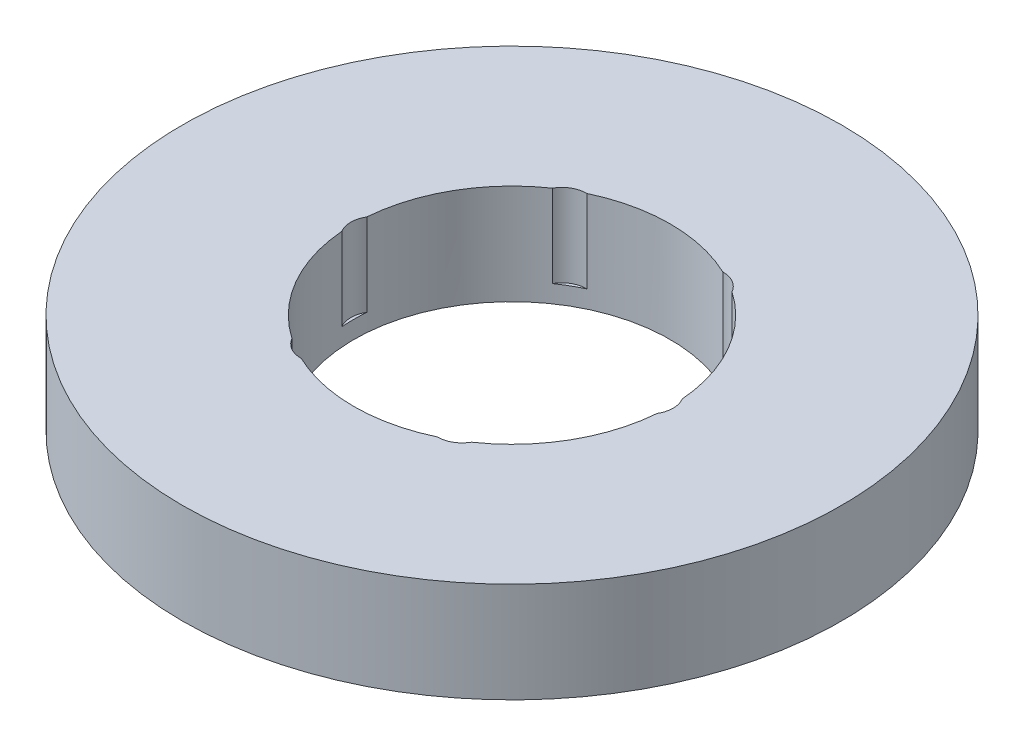
ISO-10303-21;
HEADER;
FILE_DESCRIPTION(('STEP AP214'),'2;1');
FILE_NAME('part.step','',(''),(''),'','','');
FILE_SCHEMA(('AUTOMOTIVE_DESIGN { 1 0 10303 214 1 1 1 1 }'));
ENDSEC;
DATA;
#1=APPLICATION_CONTEXT('core data for automotive mechanical design processes');
#2=APPLICATION_PROTOCOL_DEFINITION('international standard','automotive_design',2000,#1);
#3=PRODUCT_CONTEXT('',#1,'mechanical');
#4=PRODUCT('Part','Part','',(#3));
#5=PRODUCT_RELATED_PRODUCT_CATEGORY('part','',(#4));
#6=PRODUCT_DEFINITION_FORMATION('','',#4);
#7=PRODUCT_DEFINITION_CONTEXT('part definition',#1,'design');
#8=PRODUCT_DEFINITION('design','',#6,#7);
#9=PRODUCT_DEFINITION_SHAPE('','',#8);
#10=(LENGTH_UNIT() NAMED_UNIT(*) SI_UNIT(.MILLI.,.METRE.));
#11=(NAMED_UNIT(*) PLANE_ANGLE_UNIT() SI_UNIT($,.RADIAN.));
#12=(NAMED_UNIT(*) SI_UNIT($,.STERADIAN.) SOLID_ANGLE_UNIT());
#13=UNCERTAINTY_MEASURE_WITH_UNIT(LENGTH_MEASURE(1.E-05),#10,'distance_accuracy_value','');
#14=(GEOMETRIC_REPRESENTATION_CONTEXT(3) GLOBAL_UNCERTAINTY_ASSIGNED_CONTEXT((#13)) GLOBAL_UNIT_ASSIGNED_CONTEXT((#10,
#11,#12)) REPRESENTATION_CONTEXT('',''));
#15=CARTESIAN_POINT('',(0.,0.,0.));
#16=DIRECTION('',(0.,0.,1.));
#17=DIRECTION('',(1.,0.,0.));
#18=AXIS2_PLACEMENT_3D('',#15,#16,#17);
#19=CARTESIAN_POINT('',(0.,19.,0.));
#20=DIRECTION('',(0.,-1.,0.));
#21=DIRECTION('',(0.,0.,-1.));
#22=AXIS2_PLACEMENT_3D('',#19,#20,#21);
#23=CYLINDRICAL_SURFACE('',#22,62.5);
#24=CARTESIAN_POINT('',(0.,19.,0.));
#25=DIRECTION('',(0.,1.,0.));
#26=DIRECTION('',(0.,0.,1.));
#27=AXIS2_PLACEMENT_3D('',#24,#25,#26);
#28=CIRCLE('',#27,62.5);
#29=CARTESIAN_POINT('',(0.,19.,62.5));
#30=VERTEX_POINT('',#29);
#31=EDGE_CURVE('E162',#30,#30,#28,.T.);
#32=ORIENTED_EDGE('',*,*,#31,.F.);
#33=EDGE_LOOP('',(#32));
#34=FACE_BOUND('',#33,.T.);
#35=CARTESIAN_POINT('',(0.,0.,0.));
#36=DIRECTION('',(0.,1.,0.));
#37=DIRECTION('',(0.,0.,1.));
#38=AXIS2_PLACEMENT_3D('',#35,#36,#37);
#39=CIRCLE('',#38,62.5);
#40=CARTESIAN_POINT('',(0.,0.,62.5));
#41=VERTEX_POINT('',#40);
#42=EDGE_CURVE('E157',#41,#41,#39,.T.);
#43=ORIENTED_EDGE('',*,*,#42,.T.);
#44=EDGE_LOOP('',(#43));
#45=FACE_BOUND('',#44,.T.);
#46=ADVANCED_FACE('F39',(#34,#45),#23,.T.);
#47=CARTESIAN_POINT('',(0.,19.,0.));
#48=DIRECTION('',(0.,1.,0.));
#49=DIRECTION('',(0.,0.,1.));
#50=AXIS2_PLACEMENT_3D('',#47,#48,#49);
#51=PLANE('',#50);
#52=CARTESIAN_POINT('',(-12.9536574706839,19.,-22.4363928830681));
#53=DIRECTION('',(0.,1.,0.));
#54=DIRECTION('',(-0.866025403784433,0.,0.50000000000001));
#55=AXIS2_PLACEMENT_3D('',#52,#53,#54);
#56=CIRCLE('',#55,4.65275185815203);
#57=CARTESIAN_POINT('',(-12.8918757796627,19.,-27.0887345382125));
#58=VERTEX_POINT('',#57);
#59=CARTESIAN_POINT('',(-17.0135943766342,19.,-24.7090591967271));
#60=VERTEX_POINT('',#59);
#61=EDGE_CURVE('E218',#58,#60,#56,.T.);
#62=ORIENTED_EDGE('',*,*,#61,.F.);
#63=CARTESIAN_POINT('',(0.,19.,0.));
#64=DIRECTION('',(0.,1.,0.));
#65=DIRECTION('',(0.,0.,1.));
#66=AXIS2_PLACEMENT_3D('',#63,#64,#65);
#67=CIRCLE('',#66,30.);
#68=CARTESIAN_POINT('',(12.8918757796621,19.,-27.0887345382128));
#69=VERTEX_POINT('',#68);
#70=EDGE_CURVE('E169',#69,#58,#67,.T.);
#71=ORIENTED_EDGE('',*,*,#70,.F.);
#72=CARTESIAN_POINT('',(12.9536574706834,19.,-22.4363928830684));
#73=DIRECTION('',(0.,1.,0.));
#74=DIRECTION('',(-0.866025403784443,0.,-0.499999999999992));
#75=AXIS2_PLACEMENT_3D('',#72,#73,#74);
#76=CIRCLE('',#75,4.65275185815203);
#77=CARTESIAN_POINT('',(17.0135943766336,19.,-24.7090591967274));
#78=VERTEX_POINT('',#77);
#79=EDGE_CURVE('E285',#78,#69,#76,.T.);
#80=ORIENTED_EDGE('',*,*,#79,.F.);
#81=CARTESIAN_POINT('',(29.9054701562963,19.,-2.37967534148538));
#82=VERTEX_POINT('',#81);
#83=EDGE_CURVE('E174',#82,#78,#67,.T.);
#84=ORIENTED_EDGE('',*,*,#83,.F.);
#85=CARTESIAN_POINT('',(25.9073149413673,19.,0.));
#86=DIRECTION('',(0.,1.,0.));
#87=DIRECTION('',(0.,0.,-1.));
#88=AXIS2_PLACEMENT_3D('',#85,#86,#87);
#89=CIRCLE('',#88,4.65275185815203);
#90=CARTESIAN_POINT('',(29.9054701562963,19.,2.37967534148538));
#91=VERTEX_POINT('',#90);
#92=EDGE_CURVE('E280',#91,#82,#89,.T.);
#93=ORIENTED_EDGE('',*,*,#92,.F.);
#94=CARTESIAN_POINT('',(17.013594376634,19.,24.7090591967272));
#95=VERTEX_POINT('',#94);
#96=EDGE_CURVE('E164',#95,#91,#67,.T.);
#97=ORIENTED_EDGE('',*,*,#96,.F.);
#98=CARTESIAN_POINT('',(12.9536574706838,19.,22.4363928830682));
#99=DIRECTION('',(0.,1.,0.));
#100=DIRECTION('',(0.866025403784436,0.,-0.500000000000004));
#101=AXIS2_PLACEMENT_3D('',#98,#99,#100);
#102=CIRCLE('',#101,4.65275185815203);
#103=CARTESIAN_POINT('',(12.8918757796625,19.,27.0887345382126));
#104=VERTEX_POINT('',#103);
#105=EDGE_CURVE('E269',#104,#95,#102,.T.);
#106=ORIENTED_EDGE('',*,*,#105,.F.);
#107=CARTESIAN_POINT('',(-12.8918757796623,19.,27.0887345382127));
#108=VERTEX_POINT('',#107);
#109=EDGE_CURVE('E149',#108,#104,#67,.T.);
#110=ORIENTED_EDGE('',*,*,#109,.F.);
#111=CARTESIAN_POINT('',(-12.9536574706836,19.,22.4363928830683));
#112=DIRECTION('',(0.,1.,0.));
#113=DIRECTION('',(0.86602540378444,0.,0.499999999999998));
#114=AXIS2_PLACEMENT_3D('',#111,#112,#113);
#115=CIRCLE('',#114,4.65275185815203);
#116=CARTESIAN_POINT('',(-17.0135943766338,19.,24.7090591967273));
#117=VERTEX_POINT('',#116);
#118=EDGE_CURVE('E128',#117,#108,#115,.T.);
#119=ORIENTED_EDGE('',*,*,#118,.F.);
#120=CARTESIAN_POINT('',(-29.9054701562963,19.,2.37967534148538));
#121=VERTEX_POINT('',#120);
#122=EDGE_CURVE('E148',#121,#117,#67,.T.);
#123=ORIENTED_EDGE('',*,*,#122,.F.);
#124=CARTESIAN_POINT('',(-25.9073149413673,19.,0.));
#125=DIRECTION('',(0.,1.,0.));
#126=DIRECTION('',(0.,0.,1.));
#127=AXIS2_PLACEMENT_3D('',#124,#125,#126);
#128=CIRCLE('',#127,4.65275185815203);
#129=CARTESIAN_POINT('',(-29.9054701562963,19.,-2.37967534148538));
#130=VERTEX_POINT('',#129);
#131=EDGE_CURVE('E179',#130,#121,#128,.T.);
#132=ORIENTED_EDGE('',*,*,#131,.F.);
#133=EDGE_CURVE('E161',#60,#130,#67,.T.);
#134=ORIENTED_EDGE('',*,*,#133,.F.);
#135=EDGE_LOOP('',(#62,#71,#80,#84,#93,#97,#106,#110,#119,#123,#132,#134));
#136=FACE_BOUND('',#135,.T.);
#137=ORIENTED_EDGE('',*,*,#31,.T.);
#138=EDGE_LOOP('',(#137));
#139=FACE_BOUND('',#138,.T.);
#140=ADVANCED_FACE('F141',(#136,#139),#51,.T.);
#141=CARTESIAN_POINT('',(0.,0.,0.));
#142=DIRECTION('',(0.,1.,0.));
#143=DIRECTION('',(0.,0.,1.));
#144=AXIS2_PLACEMENT_3D('',#141,#142,#143);
#145=PLANE('',#144);
#146=CARTESIAN_POINT('',(0.,0.,0.));
#147=DIRECTION('',(0.,1.,0.));
#148=DIRECTION('',(0.,0.,1.));
#149=AXIS2_PLACEMENT_3D('',#146,#147,#148);
#150=CIRCLE('',#149,30.);
#151=CARTESIAN_POINT('',(0.,0.,30.));
#152=VERTEX_POINT('',#151);
#153=EDGE_CURVE('E166',#152,#152,#150,.T.);
#154=ORIENTED_EDGE('',*,*,#153,.T.);
#155=EDGE_LOOP('',(#154));
#156=FACE_BOUND('',#155,.T.);
#157=ORIENTED_EDGE('',*,*,#42,.F.);
#158=EDGE_LOOP('',(#157));
#159=FACE_BOUND('',#158,.T.);
#160=ADVANCED_FACE('F234',(#156,#159),#145,.F.);
#161=CARTESIAN_POINT('',(0.,19.,0.));
#162=DIRECTION('',(0.,-1.,0.));
#163=DIRECTION('',(0.,0.,-1.));
#164=AXIS2_PLACEMENT_3D('',#161,#162,#163);
#165=CYLINDRICAL_SURFACE('',#164,30.);
#166=DIRECTION('',(0.,1.,0.));
#167=VECTOR('',#166,1.);
#168=CARTESIAN_POINT('',(-12.8918757796627,11.1623331256231,-27.0887345382125));
#169=LINE('',#168,#167);
#170=CARTESIAN_POINT('',(-12.8918757796627,3.32466625124611,-27.0887345382125));
#171=VERTEX_POINT('',#170);
#172=EDGE_CURVE('E11',#171,#58,#169,.T.);
#173=ORIENTED_EDGE('',*,*,#172,.F.);
#174=CARTESIAN_POINT('',(0.,3.32466625124611,0.));
#175=DIRECTION('',(0.,1.,0.));
#176=DIRECTION('',(0.,0.,1.));
#177=AXIS2_PLACEMENT_3D('',#174,#175,#176);
#178=CIRCLE('',#177,30.);
#179=CARTESIAN_POINT('',(-17.0135943766342,3.32466625124611,-24.7090591967271));
#180=VERTEX_POINT('',#179);
#181=EDGE_CURVE('E214',#171,#180,#178,.T.);
#182=ORIENTED_EDGE('',*,*,#181,.T.);
#183=DIRECTION('',(0.,1.,0.));
#184=VECTOR('',#183,1.);
#185=CARTESIAN_POINT('',(-17.0135943766342,11.1623331256231,-24.7090591967271));
#186=LINE('',#185,#184);
#187=EDGE_CURVE('E46',#60,#180,#186,.F.);
#188=ORIENTED_EDGE('',*,*,#187,.F.);
#189=ORIENTED_EDGE('',*,*,#133,.T.);
#190=DIRECTION('',(0.,1.,0.));
#191=VECTOR('',#190,1.);
#192=CARTESIAN_POINT('',(-29.9054701562963,11.1623331256231,-2.37967534148536));
#193=LINE('',#192,#191);
#194=CARTESIAN_POINT('',(-29.9054701562963,3.32466625124611,-2.37967534148538));
#195=VERTEX_POINT('',#194);
#196=EDGE_CURVE('E187',#195,#130,#193,.T.);
#197=ORIENTED_EDGE('',*,*,#196,.F.);
#198=CARTESIAN_POINT('',(0.,3.32466625124611,0.));
#199=DIRECTION('',(0.,1.,0.));
#200=DIRECTION('',(0.,0.,1.));
#201=AXIS2_PLACEMENT_3D('',#198,#199,#200);
#202=CIRCLE('',#201,30.);
#203=CARTESIAN_POINT('',(-29.9054701562963,3.32466625124611,2.37967534148538));
#204=VERTEX_POINT('',#203);
#205=EDGE_CURVE('E184',#195,#204,#202,.T.);
#206=ORIENTED_EDGE('',*,*,#205,.T.);
#207=DIRECTION('',(0.,1.,0.));
#208=VECTOR('',#207,1.);
#209=CARTESIAN_POINT('',(-29.9054701562963,11.1623331256231,2.37967534148536));
#210=LINE('',#209,#208);
#211=EDGE_CURVE('E158',#121,#204,#210,.F.);
#212=ORIENTED_EDGE('',*,*,#211,.F.);
#213=ORIENTED_EDGE('',*,*,#122,.T.);
#214=DIRECTION('',(0.,1.,0.));
#215=VECTOR('',#214,1.);
#216=CARTESIAN_POINT('',(-17.0135943766338,11.1623331256231,24.7090591967273));
#217=LINE('',#216,#215);
#218=CARTESIAN_POINT('',(-17.0135943766338,3.32466625124611,24.7090591967273));
#219=VERTEX_POINT('',#218);
#220=EDGE_CURVE('E127',#219,#117,#217,.T.);
#221=ORIENTED_EDGE('',*,*,#220,.F.);
#222=CARTESIAN_POINT('',(0.,3.32466625124611,0.));
#223=DIRECTION('',(0.,1.,0.));
#224=DIRECTION('',(0.,0.,1.));
#225=AXIS2_PLACEMENT_3D('',#222,#223,#224);
#226=CIRCLE('',#225,30.);
#227=CARTESIAN_POINT('',(-12.8918757796623,3.32466625124611,27.0887345382127));
#228=VERTEX_POINT('',#227);
#229=EDGE_CURVE('E189',#219,#228,#226,.T.);
#230=ORIENTED_EDGE('',*,*,#229,.T.);
#231=DIRECTION('',(0.,1.,0.));
#232=VECTOR('',#231,1.);
#233=CARTESIAN_POINT('',(-12.8918757796623,11.1623331256231,27.0887345382127));
#234=LINE('',#233,#232);
#235=EDGE_CURVE('E140',#108,#228,#234,.F.);
#236=ORIENTED_EDGE('',*,*,#235,.F.);
#237=ORIENTED_EDGE('',*,*,#109,.T.);
#238=DIRECTION('',(0.,1.,0.));
#239=VECTOR('',#238,1.);
#240=CARTESIAN_POINT('',(12.8918757796625,11.1623331256231,27.0887345382126));
#241=LINE('',#240,#239);
#242=CARTESIAN_POINT('',(12.8918757796625,3.32466625124611,27.0887345382126));
#243=VERTEX_POINT('',#242);
#244=EDGE_CURVE('E196',#243,#104,#241,.T.);
#245=ORIENTED_EDGE('',*,*,#244,.F.);
#246=CARTESIAN_POINT('',(0.,3.32466625124611,0.));
#247=DIRECTION('',(0.,1.,0.));
#248=DIRECTION('',(0.,0.,1.));
#249=AXIS2_PLACEMENT_3D('',#246,#247,#248);
#250=CIRCLE('',#249,30.);
#251=CARTESIAN_POINT('',(17.013594376634,3.32466625124611,24.7090591967272));
#252=VERTEX_POINT('',#251);
#253=EDGE_CURVE('E136',#243,#252,#250,.T.);
#254=ORIENTED_EDGE('',*,*,#253,.T.);
#255=DIRECTION('',(0.,1.,0.));
#256=VECTOR('',#255,1.);
#257=CARTESIAN_POINT('',(17.013594376634,11.1623331256231,24.7090591967272));
#258=LINE('',#257,#256);
#259=EDGE_CURVE('E194',#95,#252,#258,.F.);
#260=ORIENTED_EDGE('',*,*,#259,.F.);
#261=ORIENTED_EDGE('',*,*,#96,.T.);
#262=DIRECTION('',(0.,1.,0.));
#263=VECTOR('',#262,1.);
#264=CARTESIAN_POINT('',(29.9054701562963,11.1623331256231,2.37967534148536));
#265=LINE('',#264,#263);
#266=CARTESIAN_POINT('',(29.9054701562963,3.32466625124611,2.37967534148538));
#267=VERTEX_POINT('',#266);
#268=EDGE_CURVE('E206',#267,#91,#265,.T.);
#269=ORIENTED_EDGE('',*,*,#268,.F.);
#270=CARTESIAN_POINT('',(0.,3.32466625124611,0.));
#271=DIRECTION('',(0.,1.,0.));
#272=DIRECTION('',(0.,0.,1.));
#273=AXIS2_PLACEMENT_3D('',#270,#271,#272);
#274=CIRCLE('',#273,30.);
#275=CARTESIAN_POINT('',(29.9054701562963,3.32466625124611,-2.37967534148538));
#276=VERTEX_POINT('',#275);
#277=EDGE_CURVE('E199',#267,#276,#274,.T.);
#278=ORIENTED_EDGE('',*,*,#277,.T.);
#279=DIRECTION('',(0.,1.,0.));
#280=VECTOR('',#279,1.);
#281=CARTESIAN_POINT('',(29.9054701562963,11.1623331256231,-2.37967534148536));
#282=LINE('',#281,#280);
#283=EDGE_CURVE('E201',#82,#276,#282,.F.);
#284=ORIENTED_EDGE('',*,*,#283,.F.);
#285=ORIENTED_EDGE('',*,*,#83,.T.);
#286=DIRECTION('',(0.,1.,0.));
#287=VECTOR('',#286,1.);
#288=CARTESIAN_POINT('',(17.0135943766336,11.1623331256231,-24.7090591967274));
#289=LINE('',#288,#287);
#290=CARTESIAN_POINT('',(17.0135943766336,3.32466625124611,-24.7090591967274));
#291=VERTEX_POINT('',#290);
#292=EDGE_CURVE('E213',#291,#78,#289,.T.);
#293=ORIENTED_EDGE('',*,*,#292,.F.);
#294=CARTESIAN_POINT('',(0.,3.32466625124611,0.));
#295=DIRECTION('',(0.,1.,0.));
#296=DIRECTION('',(0.,0.,1.));
#297=AXIS2_PLACEMENT_3D('',#294,#295,#296);
#298=CIRCLE('',#297,30.);
#299=CARTESIAN_POINT('',(12.8918757796621,3.32466625124611,-27.0887345382128));
#300=VERTEX_POINT('',#299);
#301=EDGE_CURVE('E208',#291,#300,#298,.T.);
#302=ORIENTED_EDGE('',*,*,#301,.T.);
#303=DIRECTION('',(0.,1.,0.));
#304=VECTOR('',#303,1.);
#305=CARTESIAN_POINT('',(12.8918757796622,11.1623331256231,-27.0887345382128));
#306=LINE('',#305,#304);
#307=EDGE_CURVE('E211',#69,#300,#306,.F.);
#308=ORIENTED_EDGE('',*,*,#307,.F.);
#309=ORIENTED_EDGE('',*,*,#70,.T.);
#310=EDGE_LOOP('',(#173,#182,#188,#189,#197,#206,#212,#213,#221,#230,#236,#237,#245,#254,#260,
#261,#269,#278,#284,#285,#293,#302,#308,#309));
#311=FACE_BOUND('',#310,.T.);
#312=ORIENTED_EDGE('',*,*,#153,.F.);
#313=EDGE_LOOP('',(#312));
#314=FACE_BOUND('',#313,.T.);
#315=ADVANCED_FACE('F152',(#311,#314),#165,.F.);
#316=CARTESIAN_POINT('',(-25.9073149413673,3.32466625124611,0.));
#317=DIRECTION('',(0.,1.,0.));
#318=DIRECTION('',(0.,0.,1.));
#319=AXIS2_PLACEMENT_3D('',#316,#317,#318);
#320=CYLINDRICAL_SURFACE('',#319,4.65275185815203);
#321=ORIENTED_EDGE('',*,*,#196,.T.);
#322=ORIENTED_EDGE('',*,*,#131,.T.);
#323=ORIENTED_EDGE('',*,*,#211,.T.);
#324=CARTESIAN_POINT('',(-25.9073149413673,3.32466625124611,0.));
#325=DIRECTION('',(0.,1.,0.));
#326=DIRECTION('',(0.,0.,1.));
#327=AXIS2_PLACEMENT_3D('',#324,#325,#326);
#328=CIRCLE('',#327,4.65275185815203);
#329=EDGE_CURVE('E180',#195,#204,#328,.T.);
#330=ORIENTED_EDGE('',*,*,#329,.F.);
#331=EDGE_LOOP('',(#321,#322,#323,#330));
#332=FACE_BOUND('',#331,.T.);
#333=ADVANCED_FACE('F244',(#332),#320,.F.);
#334=CARTESIAN_POINT('',(-25.9073149413673,3.32466625124611,0.));
#335=DIRECTION('',(0.,1.,0.));
#336=DIRECTION('',(0.,0.,1.));
#337=AXIS2_PLACEMENT_3D('',#334,#335,#336);
#338=PLANE('',#337);
#339=ORIENTED_EDGE('',*,*,#329,.T.);
#340=ORIENTED_EDGE('',*,*,#205,.F.);
#341=EDGE_LOOP('',(#339,#340));
#342=FACE_BOUND('',#341,.T.);
#343=ADVANCED_FACE('F248',(#342),#338,.T.);
#344=CARTESIAN_POINT('',(-12.9536574706836,3.32466625124611,22.4363928830683));
#345=DIRECTION('',(0.,1.,0.));
#346=DIRECTION('',(0.,0.,1.));
#347=AXIS2_PLACEMENT_3D('',#344,#345,#346);
#348=CYLINDRICAL_SURFACE('',#347,4.65275185815203);
#349=ORIENTED_EDGE('',*,*,#220,.T.);
#350=ORIENTED_EDGE('',*,*,#118,.T.);
#351=ORIENTED_EDGE('',*,*,#235,.T.);
#352=CARTESIAN_POINT('',(-12.9536574706836,3.32466625124611,22.4363928830683));
#353=DIRECTION('',(0.,1.,0.));
#354=DIRECTION('',(0.86602540378444,0.,0.499999999999998));
#355=AXIS2_PLACEMENT_3D('',#352,#353,#354);
#356=CIRCLE('',#355,4.65275185815203);
#357=EDGE_CURVE('E135',#219,#228,#356,.T.);
#358=ORIENTED_EDGE('',*,*,#357,.F.);
#359=EDGE_LOOP('',(#349,#350,#351,#358));
#360=FACE_BOUND('',#359,.T.);
#361=ADVANCED_FACE('F126',(#360),#348,.F.);
#362=CARTESIAN_POINT('',(-12.9536574706836,3.32466625124611,22.4363928830683));
#363=DIRECTION('',(0.,1.,0.));
#364=DIRECTION('',(0.86602540378444,0.,0.499999999999998));
#365=AXIS2_PLACEMENT_3D('',#362,#363,#364);
#366=PLANE('',#365);
#367=ORIENTED_EDGE('',*,*,#357,.T.);
#368=ORIENTED_EDGE('',*,*,#229,.F.);
#369=EDGE_LOOP('',(#367,#368));
#370=FACE_BOUND('',#369,.T.);
#371=ADVANCED_FACE('F258',(#370),#366,.T.);
#372=CARTESIAN_POINT('',(12.9536574706838,3.32466625124611,22.4363928830682));
#373=DIRECTION('',(0.,1.,0.));
#374=DIRECTION('',(0.,0.,1.));
#375=AXIS2_PLACEMENT_3D('',#372,#373,#374);
#376=CYLINDRICAL_SURFACE('',#375,4.65275185815203);
#377=ORIENTED_EDGE('',*,*,#244,.T.);
#378=ORIENTED_EDGE('',*,*,#105,.T.);
#379=ORIENTED_EDGE('',*,*,#259,.T.);
#380=CARTESIAN_POINT('',(12.9536574706838,3.32466625124611,22.4363928830682));
#381=DIRECTION('',(0.,1.,0.));
#382=DIRECTION('',(0.866025403784436,0.,-0.500000000000004));
#383=AXIS2_PLACEMENT_3D('',#380,#381,#382);
#384=CIRCLE('',#383,4.65275185815203);
#385=EDGE_CURVE('E147',#243,#252,#384,.T.);
#386=ORIENTED_EDGE('',*,*,#385,.F.);
#387=EDGE_LOOP('',(#377,#378,#379,#386));
#388=FACE_BOUND('',#387,.T.);
#389=ADVANCED_FACE('F256',(#388),#376,.F.);
#390=CARTESIAN_POINT('',(12.9536574706838,3.32466625124611,22.4363928830682));
#391=DIRECTION('',(0.,1.,0.));
#392=DIRECTION('',(0.866025403784436,0.,-0.500000000000004));
#393=AXIS2_PLACEMENT_3D('',#390,#391,#392);
#394=PLANE('',#393);
#395=ORIENTED_EDGE('',*,*,#385,.T.);
#396=ORIENTED_EDGE('',*,*,#253,.F.);
#397=EDGE_LOOP('',(#395,#396));
#398=FACE_BOUND('',#397,.T.);
#399=ADVANCED_FACE('F263',(#398),#394,.T.);
#400=CARTESIAN_POINT('',(25.9073149413673,3.32466625124611,0.));
#401=DIRECTION('',(0.,1.,0.));
#402=DIRECTION('',(0.,0.,1.));
#403=AXIS2_PLACEMENT_3D('',#400,#401,#402);
#404=CYLINDRICAL_SURFACE('',#403,4.65275185815203);
#405=ORIENTED_EDGE('',*,*,#268,.T.);
#406=ORIENTED_EDGE('',*,*,#92,.T.);
#407=ORIENTED_EDGE('',*,*,#283,.T.);
#408=CARTESIAN_POINT('',(25.9073149413673,3.32466625124611,0.));
#409=DIRECTION('',(0.,1.,0.));
#410=DIRECTION('',(0.,0.,-1.));
#411=AXIS2_PLACEMENT_3D('',#408,#409,#410);
#412=CIRCLE('',#411,4.65275185815203);
#413=EDGE_CURVE('E273',#267,#276,#412,.T.);
#414=ORIENTED_EDGE('',*,*,#413,.F.);
#415=EDGE_LOOP('',(#405,#406,#407,#414));
#416=FACE_BOUND('',#415,.T.);
#417=ADVANCED_FACE('F297',(#416),#404,.F.);
#418=CARTESIAN_POINT('',(25.9073149413673,3.32466625124611,0.));
#419=DIRECTION('',(0.,1.,0.));
#420=DIRECTION('',(0.,0.,-1.));
#421=AXIS2_PLACEMENT_3D('',#418,#419,#420);
#422=PLANE('',#421);
#423=ORIENTED_EDGE('',*,*,#413,.T.);
#424=ORIENTED_EDGE('',*,*,#277,.F.);
#425=EDGE_LOOP('',(#423,#424));
#426=FACE_BOUND('',#425,.T.);
#427=ADVANCED_FACE('F299',(#426),#422,.T.);
#428=CARTESIAN_POINT('',(12.9536574706834,3.32466625124611,-22.4363928830684));
#429=DIRECTION('',(0.,1.,0.));
#430=DIRECTION('',(0.,0.,1.));
#431=AXIS2_PLACEMENT_3D('',#428,#429,#430);
#432=CYLINDRICAL_SURFACE('',#431,4.65275185815203);
#433=ORIENTED_EDGE('',*,*,#292,.T.);
#434=ORIENTED_EDGE('',*,*,#79,.T.);
#435=ORIENTED_EDGE('',*,*,#307,.T.);
#436=CARTESIAN_POINT('',(12.9536574706834,3.32466625124611,-22.4363928830684));
#437=DIRECTION('',(0.,1.,0.));
#438=DIRECTION('',(-0.866025403784443,0.,-0.499999999999992));
#439=AXIS2_PLACEMENT_3D('',#436,#437,#438);
#440=CIRCLE('',#439,4.65275185815203);
#441=EDGE_CURVE('E56',#291,#300,#440,.T.);
#442=ORIENTED_EDGE('',*,*,#441,.F.);
#443=EDGE_LOOP('',(#433,#434,#435,#442));
#444=FACE_BOUND('',#443,.T.);
#445=ADVANCED_FACE('F292',(#444),#432,.F.);
#446=CARTESIAN_POINT('',(12.9536574706834,3.32466625124611,-22.4363928830684));
#447=DIRECTION('',(0.,1.,0.));
#448=DIRECTION('',(-0.866025403784443,0.,-0.499999999999992));
#449=AXIS2_PLACEMENT_3D('',#446,#447,#448);
#450=PLANE('',#449);
#451=ORIENTED_EDGE('',*,*,#441,.T.);
#452=ORIENTED_EDGE('',*,*,#301,.F.);
#453=EDGE_LOOP('',(#451,#452));
#454=FACE_BOUND('',#453,.T.);
#455=ADVANCED_FACE('F226',(#454),#450,.T.);
#456=CARTESIAN_POINT('',(-12.9536574706839,3.32466625124611,-22.4363928830681));
#457=DIRECTION('',(0.,1.,0.));
#458=DIRECTION('',(0.,0.,1.));
#459=AXIS2_PLACEMENT_3D('',#456,#457,#458);
#460=CYLINDRICAL_SURFACE('',#459,4.65275185815203);
#461=ORIENTED_EDGE('',*,*,#172,.T.);
#462=ORIENTED_EDGE('',*,*,#61,.T.);
#463=ORIENTED_EDGE('',*,*,#187,.T.);
#464=CARTESIAN_POINT('',(-12.9536574706839,3.32466625124611,-22.4363928830681));
#465=DIRECTION('',(0.,1.,0.));
#466=DIRECTION('',(-0.866025403784433,0.,0.50000000000001));
#467=AXIS2_PLACEMENT_3D('',#464,#465,#466);
#468=CIRCLE('',#467,4.65275185815203);
#469=EDGE_CURVE('E55',#171,#180,#468,.T.);
#470=ORIENTED_EDGE('',*,*,#469,.F.);
#471=EDGE_LOOP('',(#461,#462,#463,#470));
#472=FACE_BOUND('',#471,.T.);
#473=ADVANCED_FACE('F217',(#472),#460,.F.);
#474=CARTESIAN_POINT('',(-12.9536574706839,3.32466625124611,-22.4363928830681));
#475=DIRECTION('',(0.,1.,0.));
#476=DIRECTION('',(-0.866025403784433,0.,0.50000000000001));
#477=AXIS2_PLACEMENT_3D('',#474,#475,#476);
#478=PLANE('',#477);
#479=ORIENTED_EDGE('',*,*,#469,.T.);
#480=ORIENTED_EDGE('',*,*,#181,.F.);
#481=EDGE_LOOP('',(#479,#480));
#482=FACE_BOUND('',#481,.T.);
#483=ADVANCED_FACE('F219',(#482),#478,.T.);
#484=CLOSED_SHELL('',(#46,#140,#160,#315,#333,#343,#361,#371,#389,#399,#417,#427,#445,#455,#473,#483));
#485=MANIFOLD_SOLID_BREP('B2',#484);
#486=ADVANCED_BREP_SHAPE_REPRESENTATION('',(#18,#485),#14);
#487=SHAPE_DEFINITION_REPRESENTATION(#9,#486);
ENDSEC;
END-ISO-10303-21;
